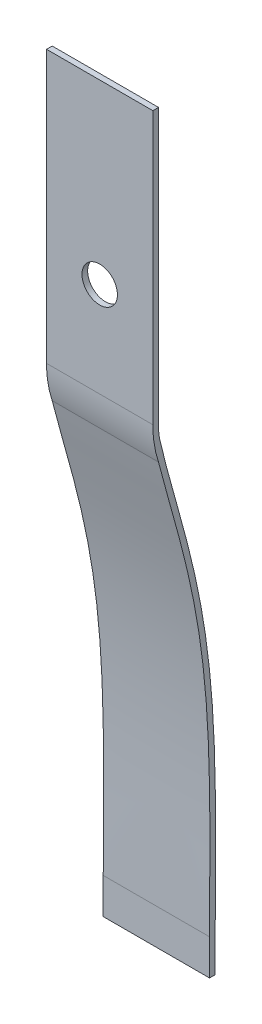
ISO-10303-21;
HEADER;
FILE_DESCRIPTION(('STEP AP214'),'2;1');
FILE_NAME('part.step','',(''),(''),'','','');
FILE_SCHEMA(('AUTOMOTIVE_DESIGN { 1 0 10303 214 1 1 1 1 }'));
ENDSEC;
DATA;
#1=APPLICATION_CONTEXT('core data for automotive mechanical design processes');
#2=APPLICATION_PROTOCOL_DEFINITION('international standard','automotive_design',2000,#1);
#3=PRODUCT_CONTEXT('',#1,'mechanical');
#4=PRODUCT('Part','Part','',(#3));
#5=PRODUCT_RELATED_PRODUCT_CATEGORY('part','',(#4));
#6=PRODUCT_DEFINITION_FORMATION('','',#4);
#7=PRODUCT_DEFINITION_CONTEXT('part definition',#1,'design');
#8=PRODUCT_DEFINITION('design','',#6,#7);
#9=PRODUCT_DEFINITION_SHAPE('','',#8);
#10=(LENGTH_UNIT() NAMED_UNIT(*) SI_UNIT(.MILLI.,.METRE.));
#11=(NAMED_UNIT(*) PLANE_ANGLE_UNIT() SI_UNIT($,.RADIAN.));
#12=(NAMED_UNIT(*) SI_UNIT($,.STERADIAN.) SOLID_ANGLE_UNIT());
#13=UNCERTAINTY_MEASURE_WITH_UNIT(LENGTH_MEASURE(1.E-05),#10,'distance_accuracy_value','');
#14=(GEOMETRIC_REPRESENTATION_CONTEXT(3) GLOBAL_UNCERTAINTY_ASSIGNED_CONTEXT((#13)) GLOBAL_UNIT_ASSIGNED_CONTEXT((#10,
#11,#12)) REPRESENTATION_CONTEXT('',''));
#15=CARTESIAN_POINT('',(0.,0.,0.));
#16=DIRECTION('',(0.,0.,1.));
#17=DIRECTION('',(1.,0.,0.));
#18=AXIS2_PLACEMENT_3D('',#15,#16,#17);
#19=CARTESIAN_POINT('',(0.,0.,0.));
#20=DIRECTION('',(0.,0.,-1.));
#21=DIRECTION('',(-1.,0.,0.));
#22=AXIS2_PLACEMENT_3D('',#19,#20,#21);
#23=PLANE('',#22);
#24=CARTESIAN_POINT('',(0.,107.95,0.));
#25=DIRECTION('',(0.,0.,1.));
#26=DIRECTION('',(1.,0.,0.));
#27=AXIS2_PLACEMENT_3D('',#24,#25,#26);
#28=CIRCLE('',#27,3.175);
#29=CARTESIAN_POINT('',(3.175,107.95,0.));
#30=VERTEX_POINT('',#29);
#31=EDGE_CURVE('E145',#30,#30,#28,.T.);
#32=ORIENTED_EDGE('',*,*,#31,.T.);
#33=EDGE_LOOP('',(#32));
#34=FACE_BOUND('',#33,.T.);
#35=DIRECTION('',(0.,1.,0.));
#36=VECTOR('',#35,1.);
#37=CARTESIAN_POINT('',(9.525,0.,0.));
#38=LINE('',#37,#36);
#39=CARTESIAN_POINT('',(9.525,90.1509479237421,0.));
#40=VERTEX_POINT('',#39);
#41=CARTESIAN_POINT('',(9.525,139.7,0.));
#42=VERTEX_POINT('',#41);
#43=EDGE_CURVE('E135',#40,#42,#38,.T.);
#44=ORIENTED_EDGE('',*,*,#43,.F.);
#45=DIRECTION('',(1.,0.,0.));
#46=VECTOR('',#45,1.);
#47=CARTESIAN_POINT('',(0.,90.1509479237421,0.));
#48=LINE('',#47,#46);
#49=CARTESIAN_POINT('',(-9.52500000000003,90.1509479237421,0.));
#50=VERTEX_POINT('',#49);
#51=EDGE_CURVE('E153',#40,#50,#48,.F.);
#52=ORIENTED_EDGE('',*,*,#51,.T.);
#53=DIRECTION('',(0.,-1.,0.));
#54=VECTOR('',#53,1.);
#55=CARTESIAN_POINT('',(-9.525,0.,0.));
#56=LINE('',#55,#54);
#57=CARTESIAN_POINT('',(-9.52500000000005,139.7,0.));
#58=VERTEX_POINT('',#57);
#59=EDGE_CURVE('E143',#58,#50,#56,.T.);
#60=ORIENTED_EDGE('',*,*,#59,.F.);
#61=DIRECTION('',(-1.,0.,0.));
#62=VECTOR('',#61,1.);
#63=CARTESIAN_POINT('',(-9.52500000000005,139.7,0.));
#64=LINE('',#63,#62);
#65=EDGE_CURVE('E132',#42,#58,#64,.T.);
#66=ORIENTED_EDGE('',*,*,#65,.F.);
#67=EDGE_LOOP('',(#44,#52,#60,#66));
#68=FACE_BOUND('',#67,.T.);
#69=ADVANCED_FACE('F32',(#34,#68),#23,.T.);
#70=CARTESIAN_POINT('',(-9.525,0.,1.016));
#71=DIRECTION('',(1.,0.,0.));
#72=DIRECTION('',(0.,1.,0.));
#73=AXIS2_PLACEMENT_3D('',#70,#71,#72);
#74=PLANE('',#73);
#75=CARTESIAN_POINT('',(-9.52500000000005,88.9121156954394,1.016));
#76=CARTESIAN_POINT('',(-9.52500000000005,72.7931267686388,-2.49788032629026));
#77=CARTESIAN_POINT('',(-9.52500000000005,58.7468680261173,-9.05640117695752));
#78=CARTESIAN_POINT('',(-9.52500000000005,42.3459915932572,-9.65555256754616));
#79=CARTESIAN_POINT('',(-9.52500000000005,23.3841648351209,-9.14399999999998));
#80=CARTESIAN_POINT('',(-9.52500000000005,6.39538559946243,-9.144));
#81=B_SPLINE_CURVE_WITH_KNOTS('',5,(#75,#76,#77,#78,#79,#80),.UNSPECIFIED.,.F.,.F.,(6,6),(0.,
1.),.UNSPECIFIED.);
#82=CARTESIAN_POINT('',(-9.52500000000005,84.6447012961835,4.65705490663992E-12));
#83=VERTEX_POINT('',#82);
#84=CARTESIAN_POINT('',(-9.52500000000005,6.39538559946243,-9.144));
#85=VERTEX_POINT('',#84);
#86=EDGE_CURVE('E124',#83,#85,#81,.T.);
#87=ORIENTED_EDGE('',*,*,#86,.F.);
#88=CARTESIAN_POINT('',(-9.52500000000005,84.6447012961835,4.65705490663992E-12));
#89=CARTESIAN_POINT('',(-9.52500000000005,87.704234074795,1.016));
#90=CARTESIAN_POINT('',(-9.52500000000005,90.9537566082065,1.016));
#91=B_SPLINE_CURVE_WITH_KNOTS('',2,(#88,#89,#90),.UNSPECIFIED.,.F.,.F.,(3,3),(0.,1.),.UNSPECIFIED.);
#92=CARTESIAN_POINT('',(-9.52500000000005,90.9537566082065,1.016));
#93=VERTEX_POINT('',#92);
#94=EDGE_CURVE('E109',#83,#93,#91,.T.);
#95=ORIENTED_EDGE('',*,*,#94,.T.);
#96=DIRECTION('',(0.,-1.,0.));
#97=VECTOR('',#96,1.);
#98=CARTESIAN_POINT('',(-9.525,0.,1.016));
#99=LINE('',#98,#97);
#100=CARTESIAN_POINT('',(-9.52500000000005,139.7,1.016));
#101=VERTEX_POINT('',#100);
#102=EDGE_CURVE('E122',#101,#93,#99,.T.);
#103=ORIENTED_EDGE('',*,*,#102,.F.);
#104=DIRECTION('',(0.,0.,-1.));
#105=VECTOR('',#104,1.);
#106=CARTESIAN_POINT('',(-9.52500000000005,139.7,1.016));
#107=LINE('',#106,#105);
#108=EDGE_CURVE('E142',#101,#58,#107,.T.);
#109=ORIENTED_EDGE('',*,*,#108,.T.);
#110=ORIENTED_EDGE('',*,*,#59,.T.);
#111=CARTESIAN_POINT('',(-9.52500000000003,90.1509479237421,-10.16));
#112=DIRECTION('',(1.,0.,0.));
#113=DIRECTION('',(0.,1.,0.));
#114=AXIS2_PLACEMENT_3D('',#111,#112,#113);
#115=CIRCLE('',#114,10.16);
#116=CARTESIAN_POINT('',(-9.52500000000005,87.8643144695002,-0.260661262188174));
#117=VERTEX_POINT('',#116);
#118=EDGE_CURVE('E40',#50,#117,#115,.T.);
#119=ORIENTED_EDGE('',*,*,#118,.T.);
#120=CARTESIAN_POINT('',(-9.52500000000005,89.1285176697962,0.0233136520055828));
#121=CARTESIAN_POINT('',(-9.52500000000005,87.4777452588777,-0.336548664685055));
#122=CARTESIAN_POINT('',(-9.52500000000005,84.182707509753,-1.14414066972838));
#123=CARTESIAN_POINT('',(-9.52500000000005,77.7372708649619,-2.91386689452682));
#124=CARTESIAN_POINT('',(-9.52500000000005,69.7349074302643,-5.1848494839027));
#125=CARTESIAN_POINT('',(-9.52500000000005,59.9446642526583,-7.46141538350429));
#126=CARTESIAN_POINT('',(-9.52500000000005,49.7868692204749,-9.04772174591774));
#127=CARTESIAN_POINT('',(-9.52500000000005,39.2122020230854,-9.92433970440907));
#128=CARTESIAN_POINT('',(-9.52500000000005,30.1079992798011,-10.1830449934907));
#129=CARTESIAN_POINT('',(-9.52500000000005,22.7478534862296,-10.2251028786919));
#130=CARTESIAN_POINT('',(-9.52500000000005,17.2263039802676,-10.2075813070374));
#131=CARTESIAN_POINT('',(-9.52500000000005,12.6640056581336,-10.1791579416986));
#132=CARTESIAN_POINT('',(-9.52500000000005,9.05650550998635,-10.1633374811313));
#133=CARTESIAN_POINT('',(-9.52500000000005,7.2851242220595,-10.16));
#134=CARTESIAN_POINT('',(-9.52500000000005,6.39538559946243,-10.16));
#135=B_SPLINE_CURVE_WITH_KNOTS('',3,(#120,#121,#122,#123,#124,#125,#126,#127,#128,#129,#130,
#131,#132,#133,#134),.UNSPECIFIED.,.F.,.F.,(4,1,1,1,1,1,1,1,1,1,1,1,4),(0.,0.0625,0.125,0.25,
0.375,0.5,0.625,0.75,0.8125,0.875,0.9375,0.96875,1.),.UNSPECIFIED.);
#136=CARTESIAN_POINT('',(-9.52500000000005,6.39538559946243,-10.16));
#137=VERTEX_POINT('',#136);
#138=EDGE_CURVE('E320',#117,#137,#135,.T.);
#139=ORIENTED_EDGE('',*,*,#138,.T.);
#140=DIRECTION('',(0.,1.,0.));
#141=VECTOR('',#140,1.);
#142=CARTESIAN_POINT('',(-9.52500000000005,0.,-10.16));
#143=LINE('',#142,#141);
#144=CARTESIAN_POINT('',(-9.52500000000005,0.,-10.16));
#145=VERTEX_POINT('',#144);
#146=EDGE_CURVE('E341',#145,#137,#143,.T.);
#147=ORIENTED_EDGE('',*,*,#146,.F.);
#148=DIRECTION('',(0.,0.,1.));
#149=VECTOR('',#148,1.);
#150=CARTESIAN_POINT('',(-9.52500000000005,0.,-10.16));
#151=LINE('',#150,#149);
#152=CARTESIAN_POINT('',(-9.52500000000005,0.,-9.144));
#153=VERTEX_POINT('',#152);
#154=EDGE_CURVE('E348',#145,#153,#151,.T.);
#155=ORIENTED_EDGE('',*,*,#154,.T.);
#156=DIRECTION('',(0.,1.,0.));
#157=VECTOR('',#156,1.);
#158=CARTESIAN_POINT('',(-9.52500000000005,0.,-9.144));
#159=LINE('',#158,#157);
#160=EDGE_CURVE('E298',#153,#85,#159,.T.);
#161=ORIENTED_EDGE('',*,*,#160,.T.);
#162=EDGE_LOOP('',(#87,#95,#103,#109,#110,#119,#139,#147,#155,#161));
#163=FACE_BOUND('',#162,.T.);
#164=ADVANCED_FACE('F120',(#163),#74,.F.);
#165=CARTESIAN_POINT('',(9.525,0.,1.016));
#166=DIRECTION('',(-1.,0.,0.));
#167=DIRECTION('',(0.,0.,1.));
#168=AXIS2_PLACEMENT_3D('',#165,#166,#167);
#169=PLANE('',#168);
#170=DIRECTION('',(0.,1.,0.));
#171=VECTOR('',#170,1.);
#172=CARTESIAN_POINT('',(9.525,0.,1.016));
#173=LINE('',#172,#171);
#174=CARTESIAN_POINT('',(9.525,90.9537566082065,1.016));
#175=VERTEX_POINT('',#174);
#176=CARTESIAN_POINT('',(9.525,139.7,1.016));
#177=VERTEX_POINT('',#176);
#178=EDGE_CURVE('E131',#175,#177,#173,.T.);
#179=ORIENTED_EDGE('',*,*,#178,.F.);
#180=CARTESIAN_POINT('',(9.525,84.6447012961835,4.65705490663992E-12));
#181=CARTESIAN_POINT('',(9.525,87.704234074795,1.016));
#182=CARTESIAN_POINT('',(9.525,90.9537566082065,1.016));
#183=B_SPLINE_CURVE_WITH_KNOTS('',2,(#180,#181,#182),.UNSPECIFIED.,.F.,.F.,(3,3),(0.,1.),.UNSPECIFIED.);
#184=CARTESIAN_POINT('',(9.525,84.644701296203,9.64975170082705E-12));
#185=VERTEX_POINT('',#184);
#186=EDGE_CURVE('E112',#185,#175,#183,.T.);
#187=ORIENTED_EDGE('',*,*,#186,.F.);
#188=CARTESIAN_POINT('',(9.525,88.9121156954394,1.016));
#189=CARTESIAN_POINT('',(9.525,72.7931267686388,-2.49788032629026));
#190=CARTESIAN_POINT('',(9.525,58.7468680261173,-9.05640117695752));
#191=CARTESIAN_POINT('',(9.525,42.3459915932572,-9.65555256754616));
#192=CARTESIAN_POINT('',(9.525,23.3841648351209,-9.14399999999998));
#193=CARTESIAN_POINT('',(9.525,6.39538559946243,-9.144));
#194=B_SPLINE_CURVE_WITH_KNOTS('',5,(#188,#189,#190,#191,#192,#193),.UNSPECIFIED.,.F.,.F.,(6,6),
(0.,1.),.UNSPECIFIED.);
#195=CARTESIAN_POINT('',(9.525,6.39538559946243,-9.144));
#196=VERTEX_POINT('',#195);
#197=EDGE_CURVE('E316',#185,#196,#194,.T.);
#198=ORIENTED_EDGE('',*,*,#197,.T.);
#199=DIRECTION('',(0.,1.,0.));
#200=VECTOR('',#199,1.);
#201=CARTESIAN_POINT('',(9.525,0.,-9.144));
#202=LINE('',#201,#200);
#203=CARTESIAN_POINT('',(9.525,0.,-9.144));
#204=VERTEX_POINT('',#203);
#205=EDGE_CURVE('E313',#204,#196,#202,.T.);
#206=ORIENTED_EDGE('',*,*,#205,.F.);
#207=DIRECTION('',(0.,0.,1.));
#208=VECTOR('',#207,1.);
#209=CARTESIAN_POINT('',(9.525,0.,-10.16));
#210=LINE('',#209,#208);
#211=CARTESIAN_POINT('',(9.525,0.,-10.16));
#212=VERTEX_POINT('',#211);
#213=EDGE_CURVE('E311',#212,#204,#210,.T.);
#214=ORIENTED_EDGE('',*,*,#213,.F.);
#215=DIRECTION('',(0.,1.,0.));
#216=VECTOR('',#215,1.);
#217=CARTESIAN_POINT('',(9.525,0.,-10.16));
#218=LINE('',#217,#216);
#219=CARTESIAN_POINT('',(9.525,6.39538559946243,-10.16));
#220=VERTEX_POINT('',#219);
#221=EDGE_CURVE('E306',#212,#220,#218,.T.);
#222=ORIENTED_EDGE('',*,*,#221,.T.);
#223=CARTESIAN_POINT('',(9.525,89.1285176697962,0.0233136520055828));
#224=CARTESIAN_POINT('',(9.525,87.4777452588777,-0.336548664685055));
#225=CARTESIAN_POINT('',(9.525,84.182707509753,-1.14414066972838));
#226=CARTESIAN_POINT('',(9.525,77.7372708649619,-2.91386689452682));
#227=CARTESIAN_POINT('',(9.525,69.7349074302643,-5.1848494839027));
#228=CARTESIAN_POINT('',(9.525,59.9446642526583,-7.46141538350429));
#229=CARTESIAN_POINT('',(9.525,49.7868692204749,-9.04772174591774));
#230=CARTESIAN_POINT('',(9.525,39.2122020230854,-9.92433970440907));
#231=CARTESIAN_POINT('',(9.525,30.1079992798011,-10.1830449934907));
#232=CARTESIAN_POINT('',(9.525,22.7478534862296,-10.2251028786919));
#233=CARTESIAN_POINT('',(9.525,17.2263039802676,-10.2075813070374));
#234=CARTESIAN_POINT('',(9.525,12.6640056581336,-10.1791579416986));
#235=CARTESIAN_POINT('',(9.525,9.05650550998635,-10.1633374811313));
#236=CARTESIAN_POINT('',(9.525,7.2851242220595,-10.16));
#237=CARTESIAN_POINT('',(9.525,6.39538559946243,-10.16));
#238=B_SPLINE_CURVE_WITH_KNOTS('',3,(#223,#224,#225,#226,#227,#228,#229,#230,#231,#232,#233,
#234,#235,#236,#237),.UNSPECIFIED.,.F.,.F.,(4,1,1,1,1,1,1,1,1,1,1,1,4),(0.,0.0625,0.125,0.25,
0.375,0.5,0.625,0.75,0.8125,0.875,0.9375,0.96875,1.),.UNSPECIFIED.);
#239=CARTESIAN_POINT('',(9.525,87.8643144695002,-0.260661262188168));
#240=VERTEX_POINT('',#239);
#241=EDGE_CURVE('E116',#240,#220,#238,.T.);
#242=ORIENTED_EDGE('',*,*,#241,.F.);
#243=CARTESIAN_POINT('',(9.525,90.1509479237421,-10.16));
#244=DIRECTION('',(-1.,0.,0.));
#245=DIRECTION('',(0.,0.,1.));
#246=AXIS2_PLACEMENT_3D('',#243,#244,#245);
#247=CIRCLE('',#246,10.16);
#248=EDGE_CURVE('E11',#240,#40,#247,.T.);
#249=ORIENTED_EDGE('',*,*,#248,.T.);
#250=ORIENTED_EDGE('',*,*,#43,.T.);
#251=DIRECTION('',(0.,0.,-1.));
#252=VECTOR('',#251,1.);
#253=CARTESIAN_POINT('',(9.525,139.7,1.016));
#254=LINE('',#253,#252);
#255=EDGE_CURVE('E148',#177,#42,#254,.T.);
#256=ORIENTED_EDGE('',*,*,#255,.F.);
#257=EDGE_LOOP('',(#179,#187,#198,#206,#214,#222,#242,#249,#250,#256));
#258=FACE_BOUND('',#257,.T.);
#259=ADVANCED_FACE('F167',(#258),#169,.F.);
#260=CARTESIAN_POINT('',(-9.52500000000005,139.7,1.016));
#261=DIRECTION('',(0.,-1.,0.));
#262=DIRECTION('',(0.,0.,-1.));
#263=AXIS2_PLACEMENT_3D('',#260,#261,#262);
#264=PLANE('',#263);
#265=ORIENTED_EDGE('',*,*,#65,.T.);
#266=ORIENTED_EDGE('',*,*,#108,.F.);
#267=DIRECTION('',(-1.,0.,0.));
#268=VECTOR('',#267,1.);
#269=CARTESIAN_POINT('',(-9.52500000000005,139.7,1.016));
#270=LINE('',#269,#268);
#271=EDGE_CURVE('E129',#177,#101,#270,.T.);
#272=ORIENTED_EDGE('',*,*,#271,.F.);
#273=ORIENTED_EDGE('',*,*,#255,.T.);
#274=EDGE_LOOP('',(#265,#266,#272,#273));
#275=FACE_BOUND('',#274,.T.);
#276=ADVANCED_FACE('F164',(#275),#264,.F.);
#277=CARTESIAN_POINT('',(0.,0.,1.016));
#278=DIRECTION('',(0.,0.,-1.));
#279=DIRECTION('',(-1.,0.,0.));
#280=AXIS2_PLACEMENT_3D('',#277,#278,#279);
#281=PLANE('',#280);
#282=ORIENTED_EDGE('',*,*,#102,.T.);
#283=DIRECTION('',(1.,0.,0.));
#284=VECTOR('',#283,1.);
#285=CARTESIAN_POINT('',(-9.52500000000005,90.9537566082065,1.016));
#286=LINE('',#285,#284);
#287=EDGE_CURVE('E106',#93,#175,#286,.T.);
#288=ORIENTED_EDGE('',*,*,#287,.T.);
#289=ORIENTED_EDGE('',*,*,#178,.T.);
#290=ORIENTED_EDGE('',*,*,#271,.T.);
#291=EDGE_LOOP('',(#282,#288,#289,#290));
#292=FACE_BOUND('',#291,.T.);
#293=CARTESIAN_POINT('',(0.,107.95,1.016));
#294=DIRECTION('',(0.,0.,1.));
#295=DIRECTION('',(1.,0.,0.));
#296=AXIS2_PLACEMENT_3D('',#293,#294,#295);
#297=CIRCLE('',#296,3.175);
#298=CARTESIAN_POINT('',(3.175,107.95,1.016));
#299=VERTEX_POINT('',#298);
#300=EDGE_CURVE('E138',#299,#299,#297,.T.);
#301=ORIENTED_EDGE('',*,*,#300,.F.);
#302=EDGE_LOOP('',(#301));
#303=FACE_BOUND('',#302,.T.);
#304=ADVANCED_FACE('F126',(#292,#303),#281,.F.);
#305=CARTESIAN_POINT('',(0.,107.95,0.));
#306=DIRECTION('',(0.,0.,1.));
#307=DIRECTION('',(1.,0.,0.));
#308=AXIS2_PLACEMENT_3D('',#305,#306,#307);
#309=CYLINDRICAL_SURFACE('',#308,3.175);
#310=ORIENTED_EDGE('',*,*,#31,.F.);
#311=EDGE_LOOP('',(#310));
#312=FACE_BOUND('',#311,.T.);
#313=ORIENTED_EDGE('',*,*,#300,.T.);
#314=EDGE_LOOP('',(#313));
#315=FACE_BOUND('',#314,.T.);
#316=ADVANCED_FACE('F204',(#312,#315),#309,.F.);
#317=DIRECTION('',(1.,0.,0.));
#318=VECTOR('',#317,1.);
#319=SURFACE_OF_LINEAR_EXTRUSION('',#135,#318);
#320=ORIENTED_EDGE('',*,*,#138,.F.);
#321=DIRECTION('',(1.,0.,0.));
#322=VECTOR('',#321,1.);
#323=CARTESIAN_POINT('',(-9.52500000000005,87.8643144695002,-0.260661262188178));
#324=LINE('',#323,#322);
#325=EDGE_CURVE('E53',#117,#240,#324,.T.);
#326=ORIENTED_EDGE('',*,*,#325,.T.);
#327=ORIENTED_EDGE('',*,*,#241,.T.);
#328=DIRECTION('',(1.,0.,0.));
#329=VECTOR('',#328,1.);
#330=CARTESIAN_POINT('',(-9.52500000000005,6.39538559946243,-10.16));
#331=LINE('',#330,#329);
#332=EDGE_CURVE('E331',#137,#220,#331,.T.);
#333=ORIENTED_EDGE('',*,*,#332,.F.);
#334=EDGE_LOOP('',(#320,#326,#327,#333));
#335=FACE_BOUND('',#334,.T.);
#336=ADVANCED_FACE('F211',(#335),#319,.F.);
#337=CARTESIAN_POINT('',(-9.52500000000005,0.,-10.16));
#338=DIRECTION('',(0.,0.,-1.));
#339=DIRECTION('',(-1.,0.,0.));
#340=AXIS2_PLACEMENT_3D('',#337,#338,#339);
#341=PLANE('',#340);
#342=ORIENTED_EDGE('',*,*,#221,.F.);
#343=DIRECTION('',(1.,0.,0.));
#344=VECTOR('',#343,1.);
#345=CARTESIAN_POINT('',(-9.52500000000005,0.,-10.16));
#346=LINE('',#345,#344);
#347=EDGE_CURVE('E329',#145,#212,#346,.T.);
#348=ORIENTED_EDGE('',*,*,#347,.F.);
#349=ORIENTED_EDGE('',*,*,#146,.T.);
#350=ORIENTED_EDGE('',*,*,#332,.T.);
#351=EDGE_LOOP('',(#342,#348,#349,#350));
#352=FACE_BOUND('',#351,.T.);
#353=ADVANCED_FACE('F218',(#352),#341,.T.);
#354=CARTESIAN_POINT('',(-9.52500000000005,0.,-10.16));
#355=DIRECTION('',(0.,1.,0.));
#356=DIRECTION('',(0.,0.,1.));
#357=AXIS2_PLACEMENT_3D('',#354,#355,#356);
#358=PLANE('',#357);
#359=ORIENTED_EDGE('',*,*,#213,.T.);
#360=DIRECTION('',(1.,0.,0.));
#361=VECTOR('',#360,1.);
#362=CARTESIAN_POINT('',(-9.52500000000005,0.,-9.144));
#363=LINE('',#362,#361);
#364=EDGE_CURVE('E326',#153,#204,#363,.T.);
#365=ORIENTED_EDGE('',*,*,#364,.F.);
#366=ORIENTED_EDGE('',*,*,#154,.F.);
#367=ORIENTED_EDGE('',*,*,#347,.T.);
#368=EDGE_LOOP('',(#359,#365,#366,#367));
#369=FACE_BOUND('',#368,.T.);
#370=ADVANCED_FACE('F224',(#369),#358,.F.);
#371=CARTESIAN_POINT('',(-9.52500000000005,0.,-9.144));
#372=DIRECTION('',(0.,0.,-1.));
#373=DIRECTION('',(-1.,0.,0.));
#374=AXIS2_PLACEMENT_3D('',#371,#372,#373);
#375=PLANE('',#374);
#376=ORIENTED_EDGE('',*,*,#205,.T.);
#377=DIRECTION('',(1.,0.,0.));
#378=VECTOR('',#377,1.);
#379=CARTESIAN_POINT('',(-9.52500000000005,6.39538559946243,-9.144));
#380=LINE('',#379,#378);
#381=EDGE_CURVE('E297',#85,#196,#380,.T.);
#382=ORIENTED_EDGE('',*,*,#381,.F.);
#383=ORIENTED_EDGE('',*,*,#160,.F.);
#384=ORIENTED_EDGE('',*,*,#364,.T.);
#385=EDGE_LOOP('',(#376,#382,#383,#384));
#386=FACE_BOUND('',#385,.T.);
#387=ADVANCED_FACE('F232',(#386),#375,.F.);
#388=DIRECTION('',(1.,0.,0.));
#389=VECTOR('',#388,1.);
#390=SURFACE_OF_LINEAR_EXTRUSION('',#81,#389);
#391=ORIENTED_EDGE('',*,*,#197,.F.);
#392=DIRECTION('',(1.,0.,0.));
#393=VECTOR('',#392,1.);
#394=CARTESIAN_POINT('',(-9.52500000000005,84.6447012961745,2.34052143985308E-12));
#395=LINE('',#394,#393);
#396=EDGE_CURVE('E151',#185,#83,#395,.F.);
#397=ORIENTED_EDGE('',*,*,#396,.T.);
#398=ORIENTED_EDGE('',*,*,#86,.T.);
#399=ORIENTED_EDGE('',*,*,#381,.T.);
#400=EDGE_LOOP('',(#391,#397,#398,#399));
#401=FACE_BOUND('',#400,.T.);
#402=ADVANCED_FACE('F173',(#401),#390,.T.);
#403=DIRECTION('',(1.,0.,0.));
#404=VECTOR('',#403,1.);
#405=SURFACE_OF_LINEAR_EXTRUSION('',#91,#404);
#406=ORIENTED_EDGE('',*,*,#186,.T.);
#407=ORIENTED_EDGE('',*,*,#287,.F.);
#408=ORIENTED_EDGE('',*,*,#94,.F.);
#409=ORIENTED_EDGE('',*,*,#396,.F.);
#410=EDGE_LOOP('',(#406,#407,#408,#409));
#411=FACE_BOUND('',#410,.T.);
#412=ADVANCED_FACE('F108',(#411),#405,.F.);
#413=CARTESIAN_POINT('',(0.,90.1509479237421,-10.16));
#414=DIRECTION('',(1.,0.,0.));
#415=DIRECTION('',(0.,0.,-1.));
#416=AXIS2_PLACEMENT_3D('',#413,#414,#415);
#417=CYLINDRICAL_SURFACE('',#416,10.16);
#418=ORIENTED_EDGE('',*,*,#248,.F.);
#419=ORIENTED_EDGE('',*,*,#325,.F.);
#420=ORIENTED_EDGE('',*,*,#118,.F.);
#421=ORIENTED_EDGE('',*,*,#51,.F.);
#422=EDGE_LOOP('',(#418,#419,#420,#421));
#423=FACE_BOUND('',#422,.T.);
#424=ADVANCED_FACE('F34',(#423),#417,.F.);
#425=CLOSED_SHELL('',(#69,#164,#259,#276,#304,#316,#336,#353,#370,#387,#402,#412,#424));
#426=MANIFOLD_SOLID_BREP('B2',#425);
#427=ADVANCED_BREP_SHAPE_REPRESENTATION('',(#18,#426),#14);
#428=SHAPE_DEFINITION_REPRESENTATION(#9,#427);
ENDSEC;
END-ISO-10303-21;
